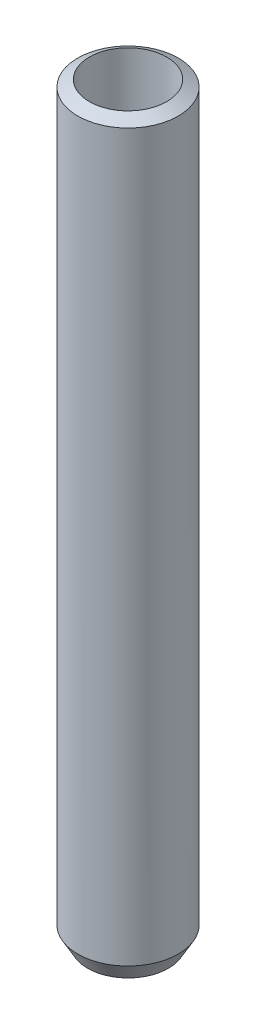
ISO-10303-21;
HEADER;
FILE_DESCRIPTION(('STEP AP214'),'2;1');
FILE_NAME('part.step','',(''),(''),'','','');
FILE_SCHEMA(('AUTOMOTIVE_DESIGN { 1 0 10303 214 1 1 1 1 }'));
ENDSEC;
DATA;
#1=APPLICATION_CONTEXT('core data for automotive mechanical design processes');
#2=APPLICATION_PROTOCOL_DEFINITION('international standard','automotive_design',2000,#1);
#3=PRODUCT_CONTEXT('',#1,'mechanical');
#4=PRODUCT('Part','Part','',(#3));
#5=PRODUCT_RELATED_PRODUCT_CATEGORY('part','',(#4));
#6=PRODUCT_DEFINITION_FORMATION('','',#4);
#7=PRODUCT_DEFINITION_CONTEXT('part definition',#1,'design');
#8=PRODUCT_DEFINITION('design','',#6,#7);
#9=PRODUCT_DEFINITION_SHAPE('','',#8);
#10=(LENGTH_UNIT() NAMED_UNIT(*) SI_UNIT(.MILLI.,.METRE.));
#11=(NAMED_UNIT(*) PLANE_ANGLE_UNIT() SI_UNIT($,.RADIAN.));
#12=(NAMED_UNIT(*) SI_UNIT($,.STERADIAN.) SOLID_ANGLE_UNIT());
#13=UNCERTAINTY_MEASURE_WITH_UNIT(LENGTH_MEASURE(1.E-05),#10,'distance_accuracy_value','');
#14=(GEOMETRIC_REPRESENTATION_CONTEXT(3) GLOBAL_UNCERTAINTY_ASSIGNED_CONTEXT((#13)) GLOBAL_UNIT_ASSIGNED_CONTEXT((#10,
#11,#12)) REPRESENTATION_CONTEXT('',''));
#15=CARTESIAN_POINT('',(0.,0.,0.));
#16=DIRECTION('',(0.,0.,1.));
#17=DIRECTION('',(1.,0.,0.));
#18=AXIS2_PLACEMENT_3D('',#15,#16,#17);
#19=CARTESIAN_POINT('',(0.,224.642858913958,0.));
#20=DIRECTION('',(0.,-1.,0.));
#21=DIRECTION('',(0.,0.,-1.));
#22=AXIS2_PLACEMENT_3D('',#19,#20,#21);
#23=CYLINDRICAL_SURFACE('',#22,15.);
#24=CARTESIAN_POINT('',(0.,221.674610655877,0.));
#25=DIRECTION('',(0.,1.,0.));
#26=DIRECTION('',(0.,0.,1.));
#27=AXIS2_PLACEMENT_3D('',#24,#25,#26);
#28=CIRCLE('',#27,15.);
#29=CARTESIAN_POINT('',(0.,221.674610655877,-15.));
#30=VERTEX_POINT('',#29);
#31=EDGE_CURVE('E50',#30,#30,#28,.F.);
#32=CARTESIAN_POINT('',(0.,5.18377227095707,0.));
#33=DIRECTION('',(0.,1.,0.));
#34=DIRECTION('',(0.,0.,1.));
#35=AXIS2_PLACEMENT_3D('',#32,#33,#34);
#36=CIRCLE('',#35,15.);
#37=CARTESIAN_POINT('',(0.,5.18377227095707,-15.));
#38=VERTEX_POINT('',#37);
#39=EDGE_CURVE('E51',#38,#38,#36,.T.);
#40=CARTESIAN_POINT('',(0.,221.674610655877,-15.));
#41=CARTESIAN_POINT('',(0.,219.419497756035,-15.));
#42=CARTESIAN_POINT('',(0.,217.164384856192,-15.));
#43=CARTESIAN_POINT('',(0.,212.654159056506,-15.));
#44=CARTESIAN_POINT('',(0.,210.399046156663,-15.));
#45=CARTESIAN_POINT('',(0.,205.888820356977,-15.));
#46=CARTESIAN_POINT('',(0.,203.633707457134,-15.));
#47=CARTESIAN_POINT('',(0.,199.123481657448,-15.));
#48=CARTESIAN_POINT('',(0.,196.868368757605,-15.));
#49=CARTESIAN_POINT('',(0.,192.358142957919,-15.));
#50=CARTESIAN_POINT('',(0.,190.103030058077,-15.));
#51=CARTESIAN_POINT('',(0.,185.592804258391,-15.));
#52=CARTESIAN_POINT('',(0.,183.337691358548,-15.));
#53=CARTESIAN_POINT('',(0.,178.827465558862,-15.));
#54=CARTESIAN_POINT('',(0.,176.572352659019,-15.));
#55=CARTESIAN_POINT('',(0.,172.062126859333,-15.));
#56=CARTESIAN_POINT('',(0.,169.80701395949,-15.));
#57=CARTESIAN_POINT('',(0.,165.296788159804,-15.));
#58=CARTESIAN_POINT('',(0.,163.041675259961,-15.));
#59=CARTESIAN_POINT('',(0.,158.531449460276,-15.));
#60=CARTESIAN_POINT('',(0.,156.276336560433,-15.));
#61=CARTESIAN_POINT('',(0.,151.766110760747,-15.));
#62=CARTESIAN_POINT('',(0.,149.510997860904,-15.));
#63=CARTESIAN_POINT('',(0.,145.000772061218,-15.));
#64=CARTESIAN_POINT('',(0.,142.745659161375,-15.));
#65=CARTESIAN_POINT('',(0.,138.235433361689,-15.));
#66=CARTESIAN_POINT('',(0.,135.980320461846,-15.));
#67=CARTESIAN_POINT('',(0.,131.470094662161,-15.));
#68=CARTESIAN_POINT('',(0.,129.214981762318,-15.));
#69=CARTESIAN_POINT('',(0.,124.704755962632,-15.));
#70=CARTESIAN_POINT('',(0.,122.449643062789,-15.));
#71=CARTESIAN_POINT('',(0.,117.939417263103,-15.));
#72=CARTESIAN_POINT('',(0.,115.68430436326,-15.));
#73=CARTESIAN_POINT('',(0.,111.174078563574,-15.));
#74=CARTESIAN_POINT('',(0.,108.918965663731,-15.));
#75=CARTESIAN_POINT('',(0.,104.408739864046,-15.));
#76=CARTESIAN_POINT('',(0.,102.153626964203,-15.));
#77=CARTESIAN_POINT('',(0.,97.6434011645168,-15.));
#78=CARTESIAN_POINT('',(0.,95.3882882646739,-15.));
#79=CARTESIAN_POINT('',(0.,90.878062464988,-15.));
#80=CARTESIAN_POINT('',(0.,88.6229495651451,-15.));
#81=CARTESIAN_POINT('',(0.,84.1127237654593,-15.));
#82=CARTESIAN_POINT('',(0.,81.8576108656164,-15.));
#83=CARTESIAN_POINT('',(0.,77.3473850659305,-15.));
#84=CARTESIAN_POINT('',(0.,75.0922721660876,-15.));
#85=CARTESIAN_POINT('',(0.,70.5820463664018,-15.));
#86=CARTESIAN_POINT('',(0.,68.3269334665588,-15.));
#87=CARTESIAN_POINT('',(0.,63.816707666873,-15.));
#88=CARTESIAN_POINT('',(0.,61.5615947670301,-15.));
#89=CARTESIAN_POINT('',(0.,57.0513689673443,-15.));
#90=CARTESIAN_POINT('',(0.,54.7962560675013,-15.));
#91=CARTESIAN_POINT('',(0.,50.2860302678155,-15.));
#92=CARTESIAN_POINT('',(0.,48.0309173679725,-15.));
#93=CARTESIAN_POINT('',(0.,43.5206915682867,-15.));
#94=CARTESIAN_POINT('',(0.,41.2655786684438,-15.));
#95=CARTESIAN_POINT('',(0.,36.7553528687579,-15.));
#96=CARTESIAN_POINT('',(0.,34.500239968915,-15.));
#97=CARTESIAN_POINT('',(0.,29.9900141692292,-15.));
#98=CARTESIAN_POINT('',(0.,27.7349012693863,-15.));
#99=CARTESIAN_POINT('',(0.,23.2246754697004,-15.));
#100=CARTESIAN_POINT('',(0.,20.9695625698575,-15.));
#101=CARTESIAN_POINT('',(0.,16.4593367701716,-15.));
#102=CARTESIAN_POINT('',(0.,14.2042238703287,-15.));
#103=CARTESIAN_POINT('',(0.,9.69399807064288,-15.));
#104=CARTESIAN_POINT('',(0.,7.43888517079997,-15.));
#105=CARTESIAN_POINT('',(0.,5.18377227095707,-15.));
#106=B_SPLINE_CURVE_WITH_KNOTS('',3,(#40,#41,#42,#43,#44,#45,#46,#47,#48,#49,#50,#51,#52,#53,
#54,#55,#56,#57,#58,#59,#60,#61,#62,#63,#64,#65,#66,#67,#68,#69,#70,#71,#72,#73,#74,#75,#76,#77,
#78,#79,#80,#81,#82,#83,#84,#85,#86,#87,#88,#89,#90,#91,#92,#93,#94,#95,#96,#97,#98,#99,#100,
#101,#102,#103,#104,#105),.UNSPECIFIED.,.F.,.F.,(4,2,2,2,2,2,2,2,2,2,2,2,2,2,2,2,2,2,2,2,2,2,2,
2,2,2,2,2,2,2,2,2,4),(0.,6.76533869952878,13.5306773990575,20.2960160985863,27.0613547981151,
33.8266934976438,40.5920321971726,47.3573708967013,54.1227095962301,60.8880482957589,
67.6533869952876,74.4187256948164,81.1840643943451,87.9494030938739,94.7147417934027,
101.480080492931,108.24541919246,115.010757891989,121.776096591518,128.541435291046,
135.306773990575,142.072112690104,148.837451389633,155.602790089162,162.36812878869,
169.133467488219,175.898806187748,182.664144887277,189.429483586805,196.194822286334,
202.960160985863,209.725499685392,216.49083838492),.UNSPECIFIED.);
#107=EDGE_CURVE('BSEAM39',#30,#38,#106,.T.);
#108=ORIENTED_EDGE('',*,*,#31,.T.);
#109=ORIENTED_EDGE('',*,*,#39,.T.);
#110=ORIENTED_EDGE('',*,*,#107,.T.);
#111=ORIENTED_EDGE('',*,*,#107,.F.);
#112=EDGE_LOOP('',(#108,#110,#109,#111));
#113=FACE_BOUND('',#112,.T.);
#114=ADVANCED_FACE('F39',(#113),#23,.T.);
#115=CARTESIAN_POINT('',(0.,0.,0.));
#116=DIRECTION('',(0.,1.,0.));
#117=DIRECTION('',(0.,0.,1.));
#118=AXIS2_PLACEMENT_3D('',#115,#116,#117);
#119=PLANE('',#118);
#120=CARTESIAN_POINT('',(0.,0.,0.));
#121=DIRECTION('',(0.,1.,0.));
#122=DIRECTION('',(0.,0.,1.));
#123=AXIS2_PLACEMENT_3D('',#120,#121,#122);
#124=CIRCLE('',#123,12.031751741919);
#125=CARTESIAN_POINT('',(0.,0.,12.031751741919));
#126=VERTEX_POINT('',#125);
#127=EDGE_CURVE('E10',#126,#126,#124,.F.);
#128=ORIENTED_EDGE('',*,*,#127,.T.);
#129=EDGE_LOOP('',(#128));
#130=FACE_BOUND('',#129,.T.);
#131=CARTESIAN_POINT('',(0.,0.,0.));
#132=DIRECTION('',(0.,1.,0.));
#133=DIRECTION('',(0.,0.,1.));
#134=AXIS2_PLACEMENT_3D('',#131,#132,#133);
#135=CIRCLE('',#134,11.5383251241741);
#136=CARTESIAN_POINT('',(0.,0.,-11.5383251241741));
#137=VERTEX_POINT('',#136);
#138=EDGE_CURVE('E58',#137,#137,#135,.T.);
#139=ORIENTED_EDGE('',*,*,#138,.T.);
#140=EDGE_LOOP('',(#139));
#141=FACE_BOUND('',#140,.T.);
#142=ADVANCED_FACE('F62',(#130,#141),#119,.F.);
#143=CARTESIAN_POINT('',(0.,224.642858913958,0.));
#144=DIRECTION('',(0.,-1.,0.));
#145=DIRECTION('',(0.,0.,-1.));
#146=AXIS2_PLACEMENT_3D('',#143,#144,#145);
#147=CYLINDRICAL_SURFACE('',#146,11.5383251241741);
#148=CARTESIAN_POINT('',(0.,223.656779216364,0.));
#149=DIRECTION('',(0.,-1.,0.));
#150=DIRECTION('',(0.,0.,-1.));
#151=AXIS2_PLACEMENT_3D('',#148,#149,#150);
#152=CIRCLE('',#151,11.5383251241741);
#153=CARTESIAN_POINT('',(0.,223.656779216364,-11.5383251241741));
#154=VERTEX_POINT('',#153);
#155=EDGE_CURVE('E54',#154,#154,#152,.F.);
#156=CARTESIAN_POINT('',(0.,223.656779216364,-11.5383251241741));
#157=CARTESIAN_POINT('',(0.,221.327021099527,-11.5383251241741));
#158=CARTESIAN_POINT('',(0.,218.99726298269,-11.5383251241741));
#159=CARTESIAN_POINT('',(0.,214.337746749015,-11.5383251241741));
#160=CARTESIAN_POINT('',(0.,212.007988632178,-11.5383251241741));
#161=CARTESIAN_POINT('',(0.,207.348472398504,-11.5383251241741));
#162=CARTESIAN_POINT('',(0.,205.018714281667,-11.5383251241741));
#163=CARTESIAN_POINT('',(0.,200.359198047993,-11.5383251241741));
#164=CARTESIAN_POINT('',(0.,198.029439931156,-11.5383251241741));
#165=CARTESIAN_POINT('',(0.,193.369923697481,-11.5383251241741));
#166=CARTESIAN_POINT('',(0.,191.040165580644,-11.5383251241741));
#167=CARTESIAN_POINT('',(0.,186.38064934697,-11.5383251241741));
#168=CARTESIAN_POINT('',(0.,184.050891230133,-11.5383251241741));
#169=CARTESIAN_POINT('',(0.,179.391374996459,-11.5383251241741));
#170=CARTESIAN_POINT('',(0.,177.061616879621,-11.5383251241741));
#171=CARTESIAN_POINT('',(0.,172.402100645947,-11.5383251241741));
#172=CARTESIAN_POINT('',(0.,170.07234252911,-11.5383251241741));
#173=CARTESIAN_POINT('',(0.,165.412826295436,-11.5383251241741));
#174=CARTESIAN_POINT('',(0.,163.083068178599,-11.5383251241741));
#175=CARTESIAN_POINT('',(0.,158.423551944924,-11.5383251241741));
#176=CARTESIAN_POINT('',(0.,156.093793828087,-11.5383251241741));
#177=CARTESIAN_POINT('',(0.,151.434277594413,-11.5383251241741));
#178=CARTESIAN_POINT('',(0.,149.104519477576,-11.5383251241741));
#179=CARTESIAN_POINT('',(0.,144.445003243902,-11.5383251241741));
#180=CARTESIAN_POINT('',(0.,142.115245127065,-11.5383251241741));
#181=CARTESIAN_POINT('',(0.,137.45572889339,-11.5383251241741));
#182=CARTESIAN_POINT('',(0.,135.125970776553,-11.5383251241741));
#183=CARTESIAN_POINT('',(0.,130.466454542879,-11.5383251241741));
#184=CARTESIAN_POINT('',(0.,128.136696426042,-11.5383251241741));
#185=CARTESIAN_POINT('',(0.,123.477180192368,-11.5383251241741));
#186=CARTESIAN_POINT('',(0.,121.14742207553,-11.5383251241741));
#187=CARTESIAN_POINT('',(0.,116.487905841856,-11.5383251241741));
#188=CARTESIAN_POINT('',(0.,114.158147725019,-11.5383251241741));
#189=CARTESIAN_POINT('',(0.,109.498631491345,-11.5383251241741));
#190=CARTESIAN_POINT('',(0.,107.168873374508,-11.5383251241741));
#191=CARTESIAN_POINT('',(0.,102.509357140833,-11.5383251241741));
#192=CARTESIAN_POINT('',(0.,100.179599023996,-11.5383251241741));
#193=CARTESIAN_POINT('',(0.,95.5200827903221,-11.5383251241741));
#194=CARTESIAN_POINT('',(0.,93.190324673485,-11.5383251241741));
#195=CARTESIAN_POINT('',(0.,88.5308084398107,-11.5383251241741));
#196=CARTESIAN_POINT('',(0.,86.2010503229736,-11.5383251241741));
#197=CARTESIAN_POINT('',(0.,81.5415340892994,-11.5383251241741));
#198=CARTESIAN_POINT('',(0.,79.2117759724622,-11.5383251241741));
#199=CARTESIAN_POINT('',(0.,74.552259738788,-11.5383251241741));
#200=CARTESIAN_POINT('',(0.,72.2225016219509,-11.5383251241741));
#201=CARTESIAN_POINT('',(0.,67.5629853882766,-11.5383251241741));
#202=CARTESIAN_POINT('',(0.,65.2332272714395,-11.5383251241741));
#203=CARTESIAN_POINT('',(0.,60.5737110377652,-11.5383251241741));
#204=CARTESIAN_POINT('',(0.,58.2439529209281,-11.5383251241741));
#205=CARTESIAN_POINT('',(0.,53.5844366872539,-11.5383251241741));
#206=CARTESIAN_POINT('',(0.,51.2546785704167,-11.5383251241741));
#207=CARTESIAN_POINT('',(0.,46.5951623367425,-11.5383251241741));
#208=CARTESIAN_POINT('',(0.,44.2654042199054,-11.5383251241741));
#209=CARTESIAN_POINT('',(0.,39.6058879862311,-11.5383251241741));
#210=CARTESIAN_POINT('',(0.,37.276129869394,-11.5383251241741));
#211=CARTESIAN_POINT('',(0.,32.6166136357198,-11.5383251241741));
#212=CARTESIAN_POINT('',(0.,30.2868555188826,-11.5383251241741));
#213=CARTESIAN_POINT('',(0.,25.6273392852084,-11.5383251241741));
#214=CARTESIAN_POINT('',(0.,23.2975811683712,-11.5383251241741));
#215=CARTESIAN_POINT('',(0.,18.638064934697,-11.5383251241741));
#216=CARTESIAN_POINT('',(0.,16.3083068178599,-11.5383251241741));
#217=CARTESIAN_POINT('',(0.,11.6487905841856,-11.5383251241741));
#218=CARTESIAN_POINT('',(0.,9.31903246734851,-11.5383251241741));
#219=CARTESIAN_POINT('',(0.,4.65951623367426,-11.5383251241741));
#220=CARTESIAN_POINT('',(0.,2.32975811683713,-11.5383251241741));
#221=CARTESIAN_POINT('',(0.,0.,-11.5383251241741));
#222=B_SPLINE_CURVE_WITH_KNOTS('',3,(#156,#157,#158,#159,#160,#161,#162,#163,#164,#165,#166,
#167,#168,#169,#170,#171,#172,#173,#174,#175,#176,#177,#178,#179,#180,#181,#182,#183,#184,#185,
#186,#187,#188,#189,#190,#191,#192,#193,#194,#195,#196,#197,#198,#199,#200,#201,#202,#203,#204,
#205,#206,#207,#208,#209,#210,#211,#212,#213,#214,#215,#216,#217,#218,#219,#220,#221),
.UNSPECIFIED.,.F.,.F.,(4,2,2,2,2,2,2,2,2,2,2,2,2,2,2,2,2,2,2,2,2,2,2,2,2,2,2,2,2,2,2,2,4),(0.,
6.98927435051136,13.9785487010227,20.9678230515341,27.9570974020455,34.9463717525569,
41.9356461030682,48.9249204535796,55.914194804091,62.9034691546023,69.8927435051137,
76.8820178556251,83.8712922061365,90.8605665566478,97.8498409071592,104.839115257671,
111.828389608182,118.817663958693,125.806938309205,132.796212659716,139.785487010227,
146.774761360739,153.76403571125,160.753310061762,167.742584412273,174.731858762784,
181.721133113296,188.710407463807,195.699681814318,202.68895616483,209.678230515341,
216.667504865853,223.656779216364),.UNSPECIFIED.);
#223=EDGE_CURVE('BSEAM68',#154,#137,#222,.T.);
#224=ORIENTED_EDGE('',*,*,#155,.T.);
#225=ORIENTED_EDGE('',*,*,#138,.F.);
#226=ORIENTED_EDGE('',*,*,#223,.T.);
#227=ORIENTED_EDGE('',*,*,#223,.F.);
#228=EDGE_LOOP('',(#224,#226,#225,#227));
#229=FACE_BOUND('',#228,.T.);
#230=ADVANCED_FACE('F68',(#229),#147,.F.);
#231=CARTESIAN_POINT('',(0.,224.642858913958,0.));
#232=DIRECTION('',(0.,-1.,0.));
#233=DIRECTION('',(0.,0.,-1.));
#234=AXIS2_PLACEMENT_3D('',#231,#232,#233);
#235=CONICAL_SURFACE('',#234,9.81622772904317,1.0507646385475);
#236=ORIENTED_EDGE('',*,*,#31,.F.);
#237=EDGE_LOOP('',(#236));
#238=FACE_BOUND('',#237,.T.);
#239=ORIENTED_EDGE('',*,*,#155,.F.);
#240=EDGE_LOOP('',(#239));
#241=FACE_BOUND('',#240,.T.);
#242=ADVANCED_FACE('F66',(#238,#241),#235,.T.);
#243=CARTESIAN_POINT('',(0.,5.18377227095707,0.));
#244=DIRECTION('',(0.,1.,0.));
#245=DIRECTION('',(0.,0.,1.));
#246=AXIS2_PLACEMENT_3D('',#243,#244,#245);
#247=CONICAL_SURFACE('',#246,15.,0.520031688247405);
#248=ORIENTED_EDGE('',*,*,#127,.F.);
#249=EDGE_LOOP('',(#248));
#250=FACE_BOUND('',#249,.T.);
#251=ORIENTED_EDGE('',*,*,#39,.F.);
#252=EDGE_LOOP('',(#251));
#253=FACE_BOUND('',#252,.T.);
#254=ADVANCED_FACE('F45',(#250,#253),#247,.T.);
#255=CLOSED_SHELL('',(#114,#142,#230,#242,#254));
#256=MANIFOLD_SOLID_BREP('B2',#255);
#257=ADVANCED_BREP_SHAPE_REPRESENTATION('',(#18,#256),#14);
#258=SHAPE_DEFINITION_REPRESENTATION(#9,#257);
ENDSEC;
END-ISO-10303-21;
